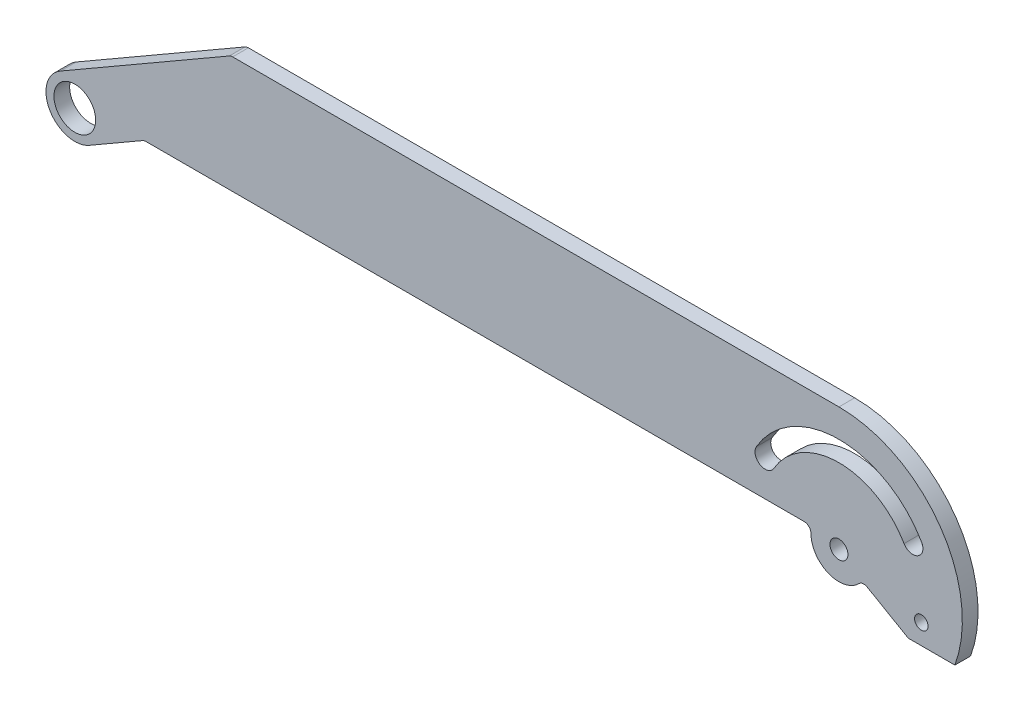
ISO-10303-21;
HEADER;
FILE_DESCRIPTION(('STEP AP214'),'2;1');
FILE_NAME('part.step','',(''),(''),'','','');
FILE_SCHEMA(('AUTOMOTIVE_DESIGN { 1 0 10303 214 1 1 1 1 }'));
ENDSEC;
DATA;
#1=APPLICATION_CONTEXT('core data for automotive mechanical design processes');
#2=APPLICATION_PROTOCOL_DEFINITION('international standard','automotive_design',2000,#1);
#3=PRODUCT_CONTEXT('',#1,'mechanical');
#4=PRODUCT('Part','Part','',(#3));
#5=PRODUCT_RELATED_PRODUCT_CATEGORY('part','',(#4));
#6=PRODUCT_DEFINITION_FORMATION('','',#4);
#7=PRODUCT_DEFINITION_CONTEXT('part definition',#1,'design');
#8=PRODUCT_DEFINITION('design','',#6,#7);
#9=PRODUCT_DEFINITION_SHAPE('','',#8);
#10=(LENGTH_UNIT() NAMED_UNIT(*) SI_UNIT(.MILLI.,.METRE.));
#11=(NAMED_UNIT(*) PLANE_ANGLE_UNIT() SI_UNIT($,.RADIAN.));
#12=(NAMED_UNIT(*) SI_UNIT($,.STERADIAN.) SOLID_ANGLE_UNIT());
#13=UNCERTAINTY_MEASURE_WITH_UNIT(LENGTH_MEASURE(1.E-05),#10,'distance_accuracy_value','');
#14=(GEOMETRIC_REPRESENTATION_CONTEXT(3) GLOBAL_UNCERTAINTY_ASSIGNED_CONTEXT((#13)) GLOBAL_UNIT_ASSIGNED_CONTEXT((#10,
#11,#12)) REPRESENTATION_CONTEXT('',''));
#15=CARTESIAN_POINT('',(0.,0.,0.));
#16=DIRECTION('',(0.,0.,1.));
#17=DIRECTION('',(1.,0.,0.));
#18=AXIS2_PLACEMENT_3D('',#15,#16,#17);
#19=CARTESIAN_POINT('',(340.6,0.,7.));
#20=DIRECTION('',(0.,0.,-1.));
#21=DIRECTION('',(-1.,0.,0.));
#22=AXIS2_PLACEMENT_3D('',#19,#20,#21);
#23=CYLINDRICAL_SURFACE('',#22,42.5000000000002);
#24=CARTESIAN_POINT('',(340.6,0.,0.));
#25=DIRECTION('',(0.,0.,1.));
#26=DIRECTION('',(1.,0.,0.));
#27=AXIS2_PLACEMENT_3D('',#24,#25,#26);
#28=CIRCLE('',#27,42.5000000000002);
#29=CARTESIAN_POINT('',(377.406079660839,21.2499999999999,0.));
#30=VERTEX_POINT('',#29);
#31=CARTESIAN_POINT('',(303.793920339161,21.2499999999998,0.));
#32=VERTEX_POINT('',#31);
#33=EDGE_CURVE('E223',#30,#32,#28,.T.);
#34=ORIENTED_EDGE('',*,*,#33,.F.);
#35=DIRECTION('',(0.,0.,-1.));
#36=VECTOR('',#35,1.);
#37=CARTESIAN_POINT('',(377.406079660839,21.2499999999999,7.));
#38=LINE('',#37,#36);
#39=CARTESIAN_POINT('',(377.406079660839,21.2499999999999,7.));
#40=VERTEX_POINT('',#39);
#41=EDGE_CURVE('E274',#40,#30,#38,.T.);
#42=ORIENTED_EDGE('',*,*,#41,.F.);
#43=CARTESIAN_POINT('',(340.6,0.,7.));
#44=DIRECTION('',(0.,0.,1.));
#45=DIRECTION('',(1.,0.,0.));
#46=AXIS2_PLACEMENT_3D('',#43,#44,#45);
#47=CIRCLE('',#46,42.5000000000002);
#48=CARTESIAN_POINT('',(303.793920339161,21.2499999999998,7.));
#49=VERTEX_POINT('',#48);
#50=EDGE_CURVE('E228',#40,#49,#47,.T.);
#51=ORIENTED_EDGE('',*,*,#50,.T.);
#52=DIRECTION('',(0.,0.,-1.));
#53=VECTOR('',#52,1.);
#54=CARTESIAN_POINT('',(303.793920339161,21.2499999999998,7.));
#55=LINE('',#54,#53);
#56=EDGE_CURVE('E249',#49,#32,#55,.T.);
#57=ORIENTED_EDGE('',*,*,#56,.T.);
#58=EDGE_LOOP('',(#34,#42,#51,#57));
#59=FACE_BOUND('',#58,.T.);
#60=ADVANCED_FACE('F37',(#59),#23,.F.);
#61=CARTESIAN_POINT('',(373.508965343809,19.,7.));
#62=DIRECTION('',(0.,0.,-1.));
#63=DIRECTION('',(-1.,0.,0.));
#64=AXIS2_PLACEMENT_3D('',#61,#62,#63);
#65=CYLINDRICAL_SURFACE('',#64,4.4999999999998);
#66=CARTESIAN_POINT('',(373.508965343809,19.,0.));
#67=DIRECTION('',(0.,0.,1.));
#68=DIRECTION('',(1.,0.,0.));
#69=AXIS2_PLACEMENT_3D('',#66,#67,#68);
#70=CIRCLE('',#69,4.4999999999998);
#71=CARTESIAN_POINT('',(369.611851026779,16.7500000000002,0.));
#72=VERTEX_POINT('',#71);
#73=EDGE_CURVE('E252',#72,#30,#70,.T.);
#74=ORIENTED_EDGE('',*,*,#73,.F.);
#75=DIRECTION('',(0.,0.,-1.));
#76=VECTOR('',#75,1.);
#77=CARTESIAN_POINT('',(369.611851026779,16.7500000000002,7.));
#78=LINE('',#77,#76);
#79=CARTESIAN_POINT('',(369.611851026779,16.7500000000002,7.));
#80=VERTEX_POINT('',#79);
#81=EDGE_CURVE('E272',#80,#72,#78,.T.);
#82=ORIENTED_EDGE('',*,*,#81,.F.);
#83=CARTESIAN_POINT('',(373.508965343809,19.,7.));
#84=DIRECTION('',(0.,0.,1.));
#85=DIRECTION('',(1.,0.,0.));
#86=AXIS2_PLACEMENT_3D('',#83,#84,#85);
#87=CIRCLE('',#86,4.4999999999998);
#88=EDGE_CURVE('E231',#80,#40,#87,.T.);
#89=ORIENTED_EDGE('',*,*,#88,.T.);
#90=ORIENTED_EDGE('',*,*,#41,.T.);
#91=EDGE_LOOP('',(#74,#82,#89,#90));
#92=FACE_BOUND('',#91,.T.);
#93=ADVANCED_FACE('F356',(#92),#65,.F.);
#94=CARTESIAN_POINT('',(340.6,0.,7.));
#95=DIRECTION('',(0.,0.,-1.));
#96=DIRECTION('',(-1.,0.,0.));
#97=AXIS2_PLACEMENT_3D('',#94,#95,#96);
#98=CYLINDRICAL_SURFACE('',#97,33.5000000000005);
#99=CARTESIAN_POINT('',(340.6,0.,0.));
#100=DIRECTION('',(0.,0.,1.));
#101=DIRECTION('',(1.,0.,0.));
#102=AXIS2_PLACEMENT_3D('',#99,#100,#101);
#103=CIRCLE('',#102,33.5000000000005);
#104=CARTESIAN_POINT('',(311.588148973221,16.75,0.));
#105=VERTEX_POINT('',#104);
#106=EDGE_CURVE('E255',#72,#105,#103,.T.);
#107=ORIENTED_EDGE('',*,*,#106,.T.);
#108=DIRECTION('',(0.,0.,-1.));
#109=VECTOR('',#108,1.);
#110=CARTESIAN_POINT('',(311.588148973221,16.75,7.));
#111=LINE('',#110,#109);
#112=CARTESIAN_POINT('',(311.588148973221,16.75,7.));
#113=VERTEX_POINT('',#112);
#114=EDGE_CURVE('E270',#113,#105,#111,.T.);
#115=ORIENTED_EDGE('',*,*,#114,.F.);
#116=CARTESIAN_POINT('',(340.6,0.,7.));
#117=DIRECTION('',(0.,0.,1.));
#118=DIRECTION('',(1.,0.,0.));
#119=AXIS2_PLACEMENT_3D('',#116,#117,#118);
#120=CIRCLE('',#119,33.5000000000005);
#121=EDGE_CURVE('E235',#80,#113,#120,.T.);
#122=ORIENTED_EDGE('',*,*,#121,.F.);
#123=ORIENTED_EDGE('',*,*,#81,.T.);
#124=EDGE_LOOP('',(#107,#115,#122,#123));
#125=FACE_BOUND('',#124,.T.);
#126=ADVANCED_FACE('F362',(#125),#98,.T.);
#127=CARTESIAN_POINT('',(377.305181398984,-9.83512371389633,7.));
#128=DIRECTION('',(0.,0.,-1.));
#129=DIRECTION('',(-1.,0.,0.));
#130=AXIS2_PLACEMENT_3D('',#127,#128,#129);
#131=CYLINDRICAL_SURFACE('',#130,2.99999999999999);
#132=CARTESIAN_POINT('',(377.305181398984,-9.83512371389633,7.));
#133=DIRECTION('',(0.,0.,1.));
#134=DIRECTION('',(1.,0.,0.));
#135=AXIS2_PLACEMENT_3D('',#132,#133,#134);
#136=CIRCLE('',#135,2.99999999999999);
#137=CARTESIAN_POINT('',(380.305181398984,-9.83512371389633,7.));
#138=VERTEX_POINT('',#137);
#139=EDGE_CURVE('E243',#138,#138,#136,.T.);
#140=ORIENTED_EDGE('',*,*,#139,.T.);
#141=EDGE_LOOP('',(#140));
#142=FACE_BOUND('',#141,.T.);
#143=CARTESIAN_POINT('',(377.305181398984,-9.83512371389633,0.));
#144=DIRECTION('',(0.,0.,1.));
#145=DIRECTION('',(1.,0.,0.));
#146=AXIS2_PLACEMENT_3D('',#143,#144,#145);
#147=CIRCLE('',#146,2.99999999999999);
#148=CARTESIAN_POINT('',(380.305181398984,-9.83512371389633,0.));
#149=VERTEX_POINT('',#148);
#150=EDGE_CURVE('E264',#149,#149,#147,.T.);
#151=ORIENTED_EDGE('',*,*,#150,.F.);
#152=EDGE_LOOP('',(#151));
#153=FACE_BOUND('',#152,.T.);
#154=ADVANCED_FACE('F391',(#142,#153),#131,.F.);
#155=CARTESIAN_POINT('',(0.,0.,7.));
#156=DIRECTION('',(0.,0.,-1.));
#157=DIRECTION('',(-1.,0.,0.));
#158=AXIS2_PLACEMENT_3D('',#155,#156,#157);
#159=CYLINDRICAL_SURFACE('',#158,9.3);
#160=CARTESIAN_POINT('',(0.,0.,7.));
#161=DIRECTION('',(0.,0.,1.));
#162=DIRECTION('',(1.,0.,0.));
#163=AXIS2_PLACEMENT_3D('',#160,#161,#162);
#164=CIRCLE('',#163,9.3);
#165=CARTESIAN_POINT('',(9.3,0.,7.));
#166=VERTEX_POINT('',#165);
#167=EDGE_CURVE('E240',#166,#166,#164,.T.);
#168=ORIENTED_EDGE('',*,*,#167,.T.);
#169=EDGE_LOOP('',(#168));
#170=FACE_BOUND('',#169,.T.);
#171=CARTESIAN_POINT('',(0.,0.,0.));
#172=DIRECTION('',(0.,0.,1.));
#173=DIRECTION('',(1.,0.,0.));
#174=AXIS2_PLACEMENT_3D('',#171,#172,#173);
#175=CIRCLE('',#174,9.3);
#176=CARTESIAN_POINT('',(9.3,0.,0.));
#177=VERTEX_POINT('',#176);
#178=EDGE_CURVE('E261',#177,#177,#175,.T.);
#179=ORIENTED_EDGE('',*,*,#178,.F.);
#180=EDGE_LOOP('',(#179));
#181=FACE_BOUND('',#180,.T.);
#182=ADVANCED_FACE('F394',(#170,#181),#159,.F.);
#183=CARTESIAN_POINT('',(307.691034656191,18.9999999999997,7.));
#184=DIRECTION('',(0.,0.,-1.));
#185=DIRECTION('',(-1.,0.,0.));
#186=AXIS2_PLACEMENT_3D('',#183,#184,#185);
#187=CYLINDRICAL_SURFACE('',#186,4.49999999999988);
#188=CARTESIAN_POINT('',(307.691034656191,18.9999999999997,0.));
#189=DIRECTION('',(0.,0.,1.));
#190=DIRECTION('',(1.,0.,0.));
#191=AXIS2_PLACEMENT_3D('',#188,#189,#190);
#192=CIRCLE('',#191,4.49999999999988);
#193=EDGE_CURVE('E258',#32,#105,#192,.T.);
#194=ORIENTED_EDGE('',*,*,#193,.F.);
#195=ORIENTED_EDGE('',*,*,#56,.F.);
#196=CARTESIAN_POINT('',(307.691034656191,18.9999999999997,7.));
#197=DIRECTION('',(0.,0.,1.));
#198=DIRECTION('',(1.,0.,0.));
#199=AXIS2_PLACEMENT_3D('',#196,#197,#198);
#200=CIRCLE('',#199,4.49999999999988);
#201=EDGE_CURVE('E237',#49,#113,#200,.T.);
#202=ORIENTED_EDGE('',*,*,#201,.T.);
#203=ORIENTED_EDGE('',*,*,#114,.T.);
#204=EDGE_LOOP('',(#194,#195,#202,#203));
#205=FACE_BOUND('',#204,.T.);
#206=ADVANCED_FACE('F389',(#205),#187,.F.);
#207=CARTESIAN_POINT('',(340.6,0.,7.));
#208=DIRECTION('',(0.,0.,-1.));
#209=DIRECTION('',(-1.,0.,0.));
#210=AXIS2_PLACEMENT_3D('',#207,#208,#209);
#211=CYLINDRICAL_SURFACE('',#210,3.99999999999999);
#212=CARTESIAN_POINT('',(340.6,0.,7.));
#213=DIRECTION('',(0.,0.,1.));
#214=DIRECTION('',(1.,0.,0.));
#215=AXIS2_PLACEMENT_3D('',#212,#213,#214);
#216=CIRCLE('',#215,3.99999999999999);
#217=CARTESIAN_POINT('',(344.6,0.,7.));
#218=VERTEX_POINT('',#217);
#219=EDGE_CURVE('E246',#218,#218,#216,.T.);
#220=ORIENTED_EDGE('',*,*,#219,.T.);
#221=EDGE_LOOP('',(#220));
#222=FACE_BOUND('',#221,.T.);
#223=CARTESIAN_POINT('',(340.6,0.,0.));
#224=DIRECTION('',(0.,0.,1.));
#225=DIRECTION('',(1.,0.,0.));
#226=AXIS2_PLACEMENT_3D('',#223,#224,#225);
#227=CIRCLE('',#226,3.99999999999999);
#228=CARTESIAN_POINT('',(344.6,0.,0.));
#229=VERTEX_POINT('',#228);
#230=EDGE_CURVE('E232',#229,#229,#227,.T.);
#231=ORIENTED_EDGE('',*,*,#230,.F.);
#232=EDGE_LOOP('',(#231));
#233=FACE_BOUND('',#232,.T.);
#234=ADVANCED_FACE('F384',(#222,#233),#211,.F.);
#235=CARTESIAN_POINT('',(0.,0.,7.));
#236=DIRECTION('',(0.,0.,1.));
#237=DIRECTION('',(1.,0.,0.));
#238=AXIS2_PLACEMENT_3D('',#235,#236,#237);
#239=PLANE('',#238);
#240=DIRECTION('',(1.,0.,0.));
#241=VECTOR('',#240,1.);
#242=CARTESIAN_POINT('',(0.,55.,7.));
#243=LINE('',#242,#241);
#244=CARTESIAN_POINT('',(70.3666419935807,55.,7.));
#245=VERTEX_POINT('',#244);
#246=CARTESIAN_POINT('',(340.6,55.,7.));
#247=VERTEX_POINT('',#246);
#248=EDGE_CURVE('E202',#245,#247,#243,.T.);
#249=ORIENTED_EDGE('',*,*,#248,.F.);
#250=CARTESIAN_POINT('',(70.3666419935807,52.,7.));
#251=DIRECTION('',(0.,0.,1.));
#252=DIRECTION('',(1.,0.,0.));
#253=AXIS2_PLACEMENT_3D('',#250,#251,#252);
#254=CIRCLE('',#253,3.);
#255=CARTESIAN_POINT('',(68.8666419935808,54.5980762113533,7.));
#256=VERTEX_POINT('',#255);
#257=EDGE_CURVE('E279',#245,#256,#254,.T.);
#258=ORIENTED_EDGE('',*,*,#257,.T.);
#259=DIRECTION('',(0.866025403784436,0.500000000000004,0.));
#260=VECTOR('',#259,1.);
#261=CARTESIAN_POINT('',(-6.42500000000006,11.12842643863,7.));
#262=LINE('',#261,#260);
#263=CARTESIAN_POINT('',(-6.42500000000006,11.12842643863,7.));
#264=VERTEX_POINT('',#263);
#265=EDGE_CURVE('E199',#264,#256,#262,.T.);
#266=ORIENTED_EDGE('',*,*,#265,.F.);
#267=CARTESIAN_POINT('',(0.,0.,7.));
#268=DIRECTION('',(0.,0.,1.));
#269=DIRECTION('',(1.,0.,0.));
#270=AXIS2_PLACEMENT_3D('',#267,#268,#269);
#271=CIRCLE('',#270,12.85);
#272=CARTESIAN_POINT('',(6.42499999999997,-11.1284264386301,7.));
#273=VERTEX_POINT('',#272);
#274=EDGE_CURVE('E218',#264,#273,#271,.T.);
#275=ORIENTED_EDGE('',*,*,#274,.T.);
#276=DIRECTION('',(0.866025403784438,0.500000000000001,0.));
#277=VECTOR('',#276,1.);
#278=CARTESIAN_POINT('',(6.42500000000002,-11.12842643863,7.));
#279=LINE('',#278,#277);
#280=CARTESIAN_POINT('',(30.1999999999999,2.59807621135331,7.));
#281=VERTEX_POINT('',#280);
#282=EDGE_CURVE('E215',#273,#281,#279,.T.);
#283=ORIENTED_EDGE('',*,*,#282,.T.);
#284=CARTESIAN_POINT('',(31.6999999999999,0.,7.));
#285=DIRECTION('',(0.,0.,1.));
#286=DIRECTION('',(1.,0.,0.));
#287=AXIS2_PLACEMENT_3D('',#284,#285,#286);
#288=CIRCLE('',#287,3.);
#289=CARTESIAN_POINT('',(31.6999999999999,3.,7.));
#290=VERTEX_POINT('',#289);
#291=EDGE_CURVE('E300',#281,#290,#288,.F.);
#292=ORIENTED_EDGE('',*,*,#291,.T.);
#293=DIRECTION('',(1.,0.,0.));
#294=VECTOR('',#293,1.);
#295=CARTESIAN_POINT('',(0.,3.,7.));
#296=LINE('',#295,#294);
#297=CARTESIAN_POINT('',(325.1,3.,7.));
#298=VERTEX_POINT('',#297);
#299=EDGE_CURVE('E212',#290,#298,#296,.T.);
#300=ORIENTED_EDGE('',*,*,#299,.T.);
#301=CARTESIAN_POINT('',(325.1,0.,7.));
#302=DIRECTION('',(0.,0.,1.));
#303=DIRECTION('',(1.,0.,0.));
#304=AXIS2_PLACEMENT_3D('',#301,#302,#303);
#305=CIRCLE('',#304,3.);
#306=CARTESIAN_POINT('',(328.1,0.,7.));
#307=VERTEX_POINT('',#306);
#308=EDGE_CURVE('E45',#298,#307,#305,.F.);
#309=ORIENTED_EDGE('',*,*,#308,.T.);
#310=CARTESIAN_POINT('',(340.6,0.,7.));
#311=DIRECTION('',(0.,0.,1.));
#312=DIRECTION('',(1.,0.,0.));
#313=AXIS2_PLACEMENT_3D('',#310,#311,#312);
#314=CIRCLE('',#313,12.5);
#315=CARTESIAN_POINT('',(349.5267921447,-8.74999325744424,7.));
#316=VERTEX_POINT('',#315);
#317=EDGE_CURVE('E209',#307,#316,#314,.T.);
#318=ORIENTED_EDGE('',*,*,#317,.T.);
#319=CARTESIAN_POINT('',(351.669222259428,-10.8499916392308,7.));
#320=DIRECTION('',(0.,0.,1.));
#321=DIRECTION('',(1.,0.,0.));
#322=AXIS2_PLACEMENT_3D('',#319,#320,#321);
#323=CIRCLE('',#322,3.);
#324=CARTESIAN_POINT('',(353.169328457741,-8.25197674439612,7.));
#325=VERTEX_POINT('',#324);
#326=EDGE_CURVE('E303',#316,#325,#323,.F.);
#327=ORIENTED_EDGE('',*,*,#326,.T.);
#328=DIRECTION('',(0.866004964944908,-0.500035399437648,0.));
#329=VECTOR('',#328,1.);
#330=CARTESIAN_POINT('',(84.7314551636607,146.745332312991,7.));
#331=LINE('',#330,#329);
#332=CARTESIAN_POINT('',(371.4981464387,-18.8351237138963,7.));
#333=VERTEX_POINT('',#332);
#334=EDGE_CURVE('E207',#325,#333,#331,.T.);
#335=ORIENTED_EDGE('',*,*,#334,.T.);
#336=DIRECTION('',(1.,0.,0.));
#337=VECTOR('',#336,1.);
#338=CARTESIAN_POINT('',(0.,-18.8351237138964,7.));
#339=LINE('',#338,#337);
#340=CARTESIAN_POINT('',(392.274346775573,-18.8351237138963,7.));
#341=VERTEX_POINT('',#340);
#342=EDGE_CURVE('E205',#333,#341,#339,.T.);
#343=ORIENTED_EDGE('',*,*,#342,.T.);
#344=CARTESIAN_POINT('',(340.6,0.,7.));
#345=DIRECTION('',(0.,0.,1.));
#346=DIRECTION('',(1.,0.,0.));
#347=AXIS2_PLACEMENT_3D('',#344,#345,#346);
#348=CIRCLE('',#347,55.);
#349=EDGE_CURVE('E174',#341,#247,#348,.T.);
#350=ORIENTED_EDGE('',*,*,#349,.T.);
#351=EDGE_LOOP('',(#249,#258,#266,#275,#283,#292,#300,#309,#318,#327,#335,#343,#350));
#352=FACE_BOUND('',#351,.T.);
#353=ORIENTED_EDGE('',*,*,#50,.F.);
#354=ORIENTED_EDGE('',*,*,#88,.F.);
#355=ORIENTED_EDGE('',*,*,#121,.T.);
#356=ORIENTED_EDGE('',*,*,#201,.F.);
#357=EDGE_LOOP('',(#353,#354,#355,#356));
#358=FACE_BOUND('',#357,.T.);
#359=ORIENTED_EDGE('',*,*,#167,.F.);
#360=EDGE_LOOP('',(#359));
#361=FACE_BOUND('',#360,.T.);
#362=ORIENTED_EDGE('',*,*,#139,.F.);
#363=EDGE_LOOP('',(#362));
#364=FACE_BOUND('',#363,.T.);
#365=ORIENTED_EDGE('',*,*,#219,.F.);
#366=EDGE_LOOP('',(#365));
#367=FACE_BOUND('',#366,.T.);
#368=ADVANCED_FACE('F309',(#352,#358,#361,#364,#367),#239,.T.);
#369=CARTESIAN_POINT('',(0.,0.,0.));
#370=DIRECTION('',(0.,0.,1.));
#371=DIRECTION('',(1.,0.,0.));
#372=AXIS2_PLACEMENT_3D('',#369,#370,#371);
#373=PLANE('',#372);
#374=DIRECTION('',(0.866025403784436,0.500000000000004,0.));
#375=VECTOR('',#374,1.);
#376=CARTESIAN_POINT('',(-6.42500000000006,11.12842643863,0.));
#377=LINE('',#376,#375);
#378=CARTESIAN_POINT('',(-6.42500000000006,11.12842643863,0.));
#379=VERTEX_POINT('',#378);
#380=CARTESIAN_POINT('',(68.8666419935808,54.5980762113533,0.));
#381=VERTEX_POINT('',#380);
#382=EDGE_CURVE('E185',#379,#381,#377,.T.);
#383=ORIENTED_EDGE('',*,*,#382,.T.);
#384=CARTESIAN_POINT('',(70.3666419935807,52.,0.));
#385=DIRECTION('',(0.,0.,1.));
#386=DIRECTION('',(1.,0.,0.));
#387=AXIS2_PLACEMENT_3D('',#384,#385,#386);
#388=CIRCLE('',#387,3.);
#389=CARTESIAN_POINT('',(70.3666419935807,55.,0.));
#390=VERTEX_POINT('',#389);
#391=EDGE_CURVE('E283',#381,#390,#388,.F.);
#392=ORIENTED_EDGE('',*,*,#391,.T.);
#393=DIRECTION('',(1.,0.,0.));
#394=VECTOR('',#393,1.);
#395=CARTESIAN_POINT('',(0.,55.,0.));
#396=LINE('',#395,#394);
#397=CARTESIAN_POINT('',(340.6,55.,0.));
#398=VERTEX_POINT('',#397);
#399=EDGE_CURVE('E182',#390,#398,#396,.T.);
#400=ORIENTED_EDGE('',*,*,#399,.T.);
#401=CARTESIAN_POINT('',(340.6,0.,0.));
#402=DIRECTION('',(0.,0.,1.));
#403=DIRECTION('',(1.,0.,0.));
#404=AXIS2_PLACEMENT_3D('',#401,#402,#403);
#405=CIRCLE('',#404,55.);
#406=CARTESIAN_POINT('',(392.274346775573,-18.8351237138963,0.));
#407=VERTEX_POINT('',#406);
#408=EDGE_CURVE('E167',#407,#398,#405,.T.);
#409=ORIENTED_EDGE('',*,*,#408,.F.);
#410=DIRECTION('',(1.,0.,0.));
#411=VECTOR('',#410,1.);
#412=CARTESIAN_POINT('',(0.,-18.8351237138964,0.));
#413=LINE('',#412,#411);
#414=CARTESIAN_POINT('',(371.4981464387,-18.8351237138963,0.));
#415=VERTEX_POINT('',#414);
#416=EDGE_CURVE('E156',#415,#407,#413,.T.);
#417=ORIENTED_EDGE('',*,*,#416,.F.);
#418=DIRECTION('',(0.866004964944908,-0.500035399437648,0.));
#419=VECTOR('',#418,1.);
#420=CARTESIAN_POINT('',(84.7314551636607,146.745332312991,0.));
#421=LINE('',#420,#419);
#422=CARTESIAN_POINT('',(353.169328457741,-8.25197674439612,0.));
#423=VERTEX_POINT('',#422);
#424=EDGE_CURVE('E166',#423,#415,#421,.T.);
#425=ORIENTED_EDGE('',*,*,#424,.F.);
#426=CARTESIAN_POINT('',(351.669222259428,-10.8499916392308,0.));
#427=DIRECTION('',(0.,0.,1.));
#428=DIRECTION('',(1.,0.,0.));
#429=AXIS2_PLACEMENT_3D('',#426,#427,#428);
#430=CIRCLE('',#429,3.);
#431=CARTESIAN_POINT('',(349.5267921447,-8.74999325744424,0.));
#432=VERTEX_POINT('',#431);
#433=EDGE_CURVE('E305',#423,#432,#430,.T.);
#434=ORIENTED_EDGE('',*,*,#433,.T.);
#435=CARTESIAN_POINT('',(340.6,0.,0.));
#436=DIRECTION('',(0.,0.,1.));
#437=DIRECTION('',(1.,0.,0.));
#438=AXIS2_PLACEMENT_3D('',#435,#436,#437);
#439=CIRCLE('',#438,12.5);
#440=CARTESIAN_POINT('',(328.1,0.,0.));
#441=VERTEX_POINT('',#440);
#442=EDGE_CURVE('E190',#441,#432,#439,.T.);
#443=ORIENTED_EDGE('',*,*,#442,.F.);
#444=CARTESIAN_POINT('',(325.1,0.,0.));
#445=DIRECTION('',(0.,0.,1.));
#446=DIRECTION('',(1.,0.,0.));
#447=AXIS2_PLACEMENT_3D('',#444,#445,#446);
#448=CIRCLE('',#447,3.);
#449=CARTESIAN_POINT('',(325.1,3.,0.));
#450=VERTEX_POINT('',#449);
#451=EDGE_CURVE('E11',#441,#450,#448,.T.);
#452=ORIENTED_EDGE('',*,*,#451,.T.);
#453=DIRECTION('',(1.,0.,0.));
#454=VECTOR('',#453,1.);
#455=CARTESIAN_POINT('',(0.,3.,0.));
#456=LINE('',#455,#454);
#457=CARTESIAN_POINT('',(31.6999999999999,3.,0.));
#458=VERTEX_POINT('',#457);
#459=EDGE_CURVE('E193',#458,#450,#456,.T.);
#460=ORIENTED_EDGE('',*,*,#459,.F.);
#461=CARTESIAN_POINT('',(31.6999999999999,0.,0.));
#462=DIRECTION('',(0.,0.,1.));
#463=DIRECTION('',(1.,0.,0.));
#464=AXIS2_PLACEMENT_3D('',#461,#462,#463);
#465=CIRCLE('',#464,3.);
#466=CARTESIAN_POINT('',(30.1999999999999,2.59807621135331,0.));
#467=VERTEX_POINT('',#466);
#468=EDGE_CURVE('E52',#458,#467,#465,.T.);
#469=ORIENTED_EDGE('',*,*,#468,.T.);
#470=DIRECTION('',(0.866025403784438,0.500000000000001,0.));
#471=VECTOR('',#470,1.);
#472=CARTESIAN_POINT('',(6.42500000000002,-11.12842643863,0.));
#473=LINE('',#472,#471);
#474=CARTESIAN_POINT('',(6.42499999999997,-11.1284264386301,0.));
#475=VERTEX_POINT('',#474);
#476=EDGE_CURVE('E195',#475,#467,#473,.T.);
#477=ORIENTED_EDGE('',*,*,#476,.F.);
#478=CARTESIAN_POINT('',(0.,0.,0.));
#479=DIRECTION('',(0.,0.,1.));
#480=DIRECTION('',(1.,0.,0.));
#481=AXIS2_PLACEMENT_3D('',#478,#479,#480);
#482=CIRCLE('',#481,12.85);
#483=EDGE_CURVE('E197',#379,#475,#482,.T.);
#484=ORIENTED_EDGE('',*,*,#483,.F.);
#485=EDGE_LOOP('',(#383,#392,#400,#409,#417,#425,#434,#443,#452,#460,#469,#477,#484));
#486=FACE_BOUND('',#485,.T.);
#487=ORIENTED_EDGE('',*,*,#33,.T.);
#488=ORIENTED_EDGE('',*,*,#193,.T.);
#489=ORIENTED_EDGE('',*,*,#106,.F.);
#490=ORIENTED_EDGE('',*,*,#73,.T.);
#491=EDGE_LOOP('',(#487,#488,#489,#490));
#492=FACE_BOUND('',#491,.T.);
#493=ORIENTED_EDGE('',*,*,#178,.T.);
#494=EDGE_LOOP('',(#493));
#495=FACE_BOUND('',#494,.T.);
#496=ORIENTED_EDGE('',*,*,#150,.T.);
#497=EDGE_LOOP('',(#496));
#498=FACE_BOUND('',#497,.T.);
#499=ORIENTED_EDGE('',*,*,#230,.T.);
#500=EDGE_LOOP('',(#499));
#501=FACE_BOUND('',#500,.T.);
#502=ADVANCED_FACE('F179',(#486,#492,#495,#498,#501),#373,.F.);
#503=CARTESIAN_POINT('',(-6.42500000000006,11.12842643863,0.));
#504=DIRECTION('',(0.500000000000004,-0.866025403784436,0.));
#505=DIRECTION('',(0.866025403784436,0.500000000000004,0.));
#506=AXIS2_PLACEMENT_3D('',#503,#504,#505);
#507=PLANE('',#506);
#508=ORIENTED_EDGE('',*,*,#265,.T.);
#509=DIRECTION('',(0.,0.,1.));
#510=VECTOR('',#509,1.);
#511=CARTESIAN_POINT('',(68.8666419935807,54.5980762113533,0.));
#512=LINE('',#511,#510);
#513=EDGE_CURVE('E281',#256,#381,#512,.F.);
#514=ORIENTED_EDGE('',*,*,#513,.T.);
#515=ORIENTED_EDGE('',*,*,#382,.F.);
#516=DIRECTION('',(0.,0.,1.));
#517=VECTOR('',#516,1.);
#518=CARTESIAN_POINT('',(-6.42500000000006,11.12842643863,0.));
#519=LINE('',#518,#517);
#520=EDGE_CURVE('E221',#379,#264,#519,.T.);
#521=ORIENTED_EDGE('',*,*,#520,.T.);
#522=EDGE_LOOP('',(#508,#514,#515,#521));
#523=FACE_BOUND('',#522,.T.);
#524=ADVANCED_FACE('F379',(#523),#507,.F.);
#525=CARTESIAN_POINT('',(0.,0.,0.));
#526=DIRECTION('',(0.,0.,1.));
#527=DIRECTION('',(1.,0.,0.));
#528=AXIS2_PLACEMENT_3D('',#525,#526,#527);
#529=CYLINDRICAL_SURFACE('',#528,12.85);
#530=ORIENTED_EDGE('',*,*,#274,.F.);
#531=ORIENTED_EDGE('',*,*,#520,.F.);
#532=ORIENTED_EDGE('',*,*,#483,.T.);
#533=DIRECTION('',(0.,0.,1.));
#534=VECTOR('',#533,1.);
#535=CARTESIAN_POINT('',(6.42499999999997,-11.1284264386301,0.));
#536=LINE('',#535,#534);
#537=EDGE_CURVE('E224',#475,#273,#536,.T.);
#538=ORIENTED_EDGE('',*,*,#537,.T.);
#539=EDGE_LOOP('',(#530,#531,#532,#538));
#540=FACE_BOUND('',#539,.T.);
#541=ADVANCED_FACE('F331',(#540),#529,.T.);
#542=CARTESIAN_POINT('',(6.42500000000002,-11.12842643863,0.));
#543=DIRECTION('',(0.500000000000001,-0.866025403784438,0.));
#544=DIRECTION('',(0.866025403784438,0.500000000000001,0.));
#545=AXIS2_PLACEMENT_3D('',#542,#543,#544);
#546=PLANE('',#545);
#547=ORIENTED_EDGE('',*,*,#476,.T.);
#548=DIRECTION('',(0.,0.,1.));
#549=VECTOR('',#548,1.);
#550=CARTESIAN_POINT('',(30.1999999999999,2.59807621135332,7.));
#551=LINE('',#550,#549);
#552=EDGE_CURVE('E285',#467,#281,#551,.T.);
#553=ORIENTED_EDGE('',*,*,#552,.T.);
#554=ORIENTED_EDGE('',*,*,#282,.F.);
#555=ORIENTED_EDGE('',*,*,#537,.F.);
#556=EDGE_LOOP('',(#547,#553,#554,#555));
#557=FACE_BOUND('',#556,.T.);
#558=ADVANCED_FACE('F326',(#557),#546,.T.);
#559=CARTESIAN_POINT('',(0.,3.,0.));
#560=DIRECTION('',(0.,-1.,0.));
#561=DIRECTION('',(1.,0.,0.));
#562=AXIS2_PLACEMENT_3D('',#559,#560,#561);
#563=PLANE('',#562);
#564=ORIENTED_EDGE('',*,*,#299,.F.);
#565=DIRECTION('',(0.,0.,1.));
#566=VECTOR('',#565,1.);
#567=CARTESIAN_POINT('',(31.6999999999999,3.,0.));
#568=LINE('',#567,#566);
#569=EDGE_CURVE('E291',#290,#458,#568,.F.);
#570=ORIENTED_EDGE('',*,*,#569,.T.);
#571=ORIENTED_EDGE('',*,*,#459,.T.);
#572=DIRECTION('',(0.,0.,-1.));
#573=VECTOR('',#572,1.);
#574=CARTESIAN_POINT('',(325.1,3.,7.));
#575=LINE('',#574,#573);
#576=EDGE_CURVE('E288',#450,#298,#575,.F.);
#577=ORIENTED_EDGE('',*,*,#576,.T.);
#578=EDGE_LOOP('',(#564,#570,#571,#577));
#579=FACE_BOUND('',#578,.T.);
#580=ADVANCED_FACE('F319',(#579),#563,.T.);
#581=CARTESIAN_POINT('',(340.6,0.,0.));
#582=DIRECTION('',(0.,0.,1.));
#583=DIRECTION('',(1.,0.,0.));
#584=AXIS2_PLACEMENT_3D('',#581,#582,#583);
#585=CYLINDRICAL_SURFACE('',#584,12.5);
#586=ORIENTED_EDGE('',*,*,#442,.T.);
#587=DIRECTION('',(0.,0.,1.));
#588=VECTOR('',#587,1.);
#589=CARTESIAN_POINT('',(349.5267921447,-8.74999325744424,0.));
#590=LINE('',#589,#588);
#591=EDGE_CURVE('E295',#432,#316,#590,.T.);
#592=ORIENTED_EDGE('',*,*,#591,.T.);
#593=ORIENTED_EDGE('',*,*,#317,.F.);
#594=DIRECTION('',(0.,0.,1.));
#595=VECTOR('',#594,1.);
#596=CARTESIAN_POINT('',(328.1,0.,0.));
#597=LINE('',#596,#595);
#598=EDGE_CURVE('E293',#307,#441,#597,.F.);
#599=ORIENTED_EDGE('',*,*,#598,.T.);
#600=EDGE_LOOP('',(#586,#592,#593,#599));
#601=FACE_BOUND('',#600,.T.);
#602=ADVANCED_FACE('F316',(#601),#585,.T.);
#603=CARTESIAN_POINT('',(84.7314551636607,146.745332312991,0.));
#604=DIRECTION('',(-0.500035399437648,-0.866004964944908,0.));
#605=DIRECTION('',(0.866004964944908,-0.500035399437648,0.));
#606=AXIS2_PLACEMENT_3D('',#603,#604,#605);
#607=PLANE('',#606);
#608=ORIENTED_EDGE('',*,*,#334,.F.);
#609=DIRECTION('',(0.,0.,-1.));
#610=VECTOR('',#609,1.);
#611=CARTESIAN_POINT('',(353.169328457741,-8.25197674439609,0.));
#612=LINE('',#611,#610);
#613=EDGE_CURVE('E298',#325,#423,#612,.T.);
#614=ORIENTED_EDGE('',*,*,#613,.T.);
#615=ORIENTED_EDGE('',*,*,#424,.T.);
#616=DIRECTION('',(0.,0.,1.));
#617=VECTOR('',#616,1.);
#618=CARTESIAN_POINT('',(371.4981464387,-18.8351237138963,0.));
#619=LINE('',#618,#617);
#620=EDGE_CURVE('E163',#415,#333,#619,.T.);
#621=ORIENTED_EDGE('',*,*,#620,.T.);
#622=EDGE_LOOP('',(#608,#614,#615,#621));
#623=FACE_BOUND('',#622,.T.);
#624=ADVANCED_FACE('F345',(#623),#607,.T.);
#625=CARTESIAN_POINT('',(0.,-18.8351237138964,0.));
#626=DIRECTION('',(0.,-1.,0.));
#627=DIRECTION('',(1.,0.,0.));
#628=AXIS2_PLACEMENT_3D('',#625,#626,#627);
#629=PLANE('',#628);
#630=ORIENTED_EDGE('',*,*,#342,.F.);
#631=ORIENTED_EDGE('',*,*,#620,.F.);
#632=ORIENTED_EDGE('',*,*,#416,.T.);
#633=DIRECTION('',(0.,0.,1.));
#634=VECTOR('',#633,1.);
#635=CARTESIAN_POINT('',(392.274346775573,-18.8351237138963,0.));
#636=LINE('',#635,#634);
#637=EDGE_CURVE('E160',#407,#341,#636,.T.);
#638=ORIENTED_EDGE('',*,*,#637,.T.);
#639=EDGE_LOOP('',(#630,#631,#632,#638));
#640=FACE_BOUND('',#639,.T.);
#641=ADVANCED_FACE('F159',(#640),#629,.T.);
#642=CARTESIAN_POINT('',(340.6,0.,0.));
#643=DIRECTION('',(0.,0.,1.));
#644=DIRECTION('',(1.,0.,0.));
#645=AXIS2_PLACEMENT_3D('',#642,#643,#644);
#646=CYLINDRICAL_SURFACE('',#645,55.);
#647=ORIENTED_EDGE('',*,*,#349,.F.);
#648=ORIENTED_EDGE('',*,*,#637,.F.);
#649=ORIENTED_EDGE('',*,*,#408,.T.);
#650=DIRECTION('',(0.,0.,1.));
#651=VECTOR('',#650,1.);
#652=CARTESIAN_POINT('',(340.6,55.,0.));
#653=LINE('',#652,#651);
#654=EDGE_CURVE('E176',#398,#247,#653,.T.);
#655=ORIENTED_EDGE('',*,*,#654,.T.);
#656=EDGE_LOOP('',(#647,#648,#649,#655));
#657=FACE_BOUND('',#656,.T.);
#658=ADVANCED_FACE('F171',(#657),#646,.T.);
#659=CARTESIAN_POINT('',(0.,55.,0.));
#660=DIRECTION('',(0.,-1.,0.));
#661=DIRECTION('',(0.,0.,-1.));
#662=AXIS2_PLACEMENT_3D('',#659,#660,#661);
#663=PLANE('',#662);
#664=ORIENTED_EDGE('',*,*,#399,.F.);
#665=DIRECTION('',(0.,0.,1.));
#666=VECTOR('',#665,1.);
#667=CARTESIAN_POINT('',(70.3666419935807,55.,0.));
#668=LINE('',#667,#666);
#669=EDGE_CURVE('E276',#390,#245,#668,.T.);
#670=ORIENTED_EDGE('',*,*,#669,.T.);
#671=ORIENTED_EDGE('',*,*,#248,.T.);
#672=ORIENTED_EDGE('',*,*,#654,.F.);
#673=EDGE_LOOP('',(#664,#670,#671,#672));
#674=FACE_BOUND('',#673,.T.);
#675=ADVANCED_FACE('F341',(#674),#663,.F.);
#676=CARTESIAN_POINT('',(70.3666419935807,52.,0.));
#677=DIRECTION('',(0.,0.,1.));
#678=DIRECTION('',(1.,0.,0.));
#679=AXIS2_PLACEMENT_3D('',#676,#677,#678);
#680=CYLINDRICAL_SURFACE('',#679,3.);
#681=ORIENTED_EDGE('',*,*,#391,.F.);
#682=ORIENTED_EDGE('',*,*,#513,.F.);
#683=ORIENTED_EDGE('',*,*,#257,.F.);
#684=ORIENTED_EDGE('',*,*,#669,.F.);
#685=EDGE_LOOP('',(#681,#682,#683,#684));
#686=FACE_BOUND('',#685,.T.);
#687=ADVANCED_FACE('F339',(#686),#680,.T.);
#688=CARTESIAN_POINT('',(31.6999999999999,0.,0.));
#689=DIRECTION('',(0.,0.,-1.));
#690=DIRECTION('',(-1.,0.,0.));
#691=AXIS2_PLACEMENT_3D('',#688,#689,#690);
#692=CYLINDRICAL_SURFACE('',#691,3.);
#693=ORIENTED_EDGE('',*,*,#468,.F.);
#694=ORIENTED_EDGE('',*,*,#569,.F.);
#695=ORIENTED_EDGE('',*,*,#291,.F.);
#696=ORIENTED_EDGE('',*,*,#552,.F.);
#697=EDGE_LOOP('',(#693,#694,#695,#696));
#698=FACE_BOUND('',#697,.T.);
#699=ADVANCED_FACE('F323',(#698),#692,.F.);
#700=CARTESIAN_POINT('',(351.669222259428,-10.8499916392308,0.));
#701=DIRECTION('',(0.,0.,1.));
#702=DIRECTION('',(1.,0.,0.));
#703=AXIS2_PLACEMENT_3D('',#700,#701,#702);
#704=CYLINDRICAL_SURFACE('',#703,3.);
#705=ORIENTED_EDGE('',*,*,#433,.F.);
#706=ORIENTED_EDGE('',*,*,#613,.F.);
#707=ORIENTED_EDGE('',*,*,#326,.F.);
#708=ORIENTED_EDGE('',*,*,#591,.F.);
#709=EDGE_LOOP('',(#705,#706,#707,#708));
#710=FACE_BOUND('',#709,.T.);
#711=ADVANCED_FACE('F348',(#710),#704,.F.);
#712=CARTESIAN_POINT('',(325.1,0.,0.));
#713=DIRECTION('',(0.,0.,1.));
#714=DIRECTION('',(1.,0.,0.));
#715=AXIS2_PLACEMENT_3D('',#712,#713,#714);
#716=CYLINDRICAL_SURFACE('',#715,3.);
#717=ORIENTED_EDGE('',*,*,#451,.F.);
#718=ORIENTED_EDGE('',*,*,#598,.F.);
#719=ORIENTED_EDGE('',*,*,#308,.F.);
#720=ORIENTED_EDGE('',*,*,#576,.F.);
#721=EDGE_LOOP('',(#717,#718,#719,#720));
#722=FACE_BOUND('',#721,.T.);
#723=ADVANCED_FACE('F39',(#722),#716,.F.);
#724=CLOSED_SHELL('',(#60,#93,#126,#154,#182,#206,#234,#368,#502,#524,#541,#558,#580,#602,#624,
#641,#658,#675,#687,#699,#711,#723));
#725=MANIFOLD_SOLID_BREP('B2',#724);
#726=ADVANCED_BREP_SHAPE_REPRESENTATION('',(#18,#725),#14);
#727=SHAPE_DEFINITION_REPRESENTATION(#9,#726);
ENDSEC;
END-ISO-10303-21;
